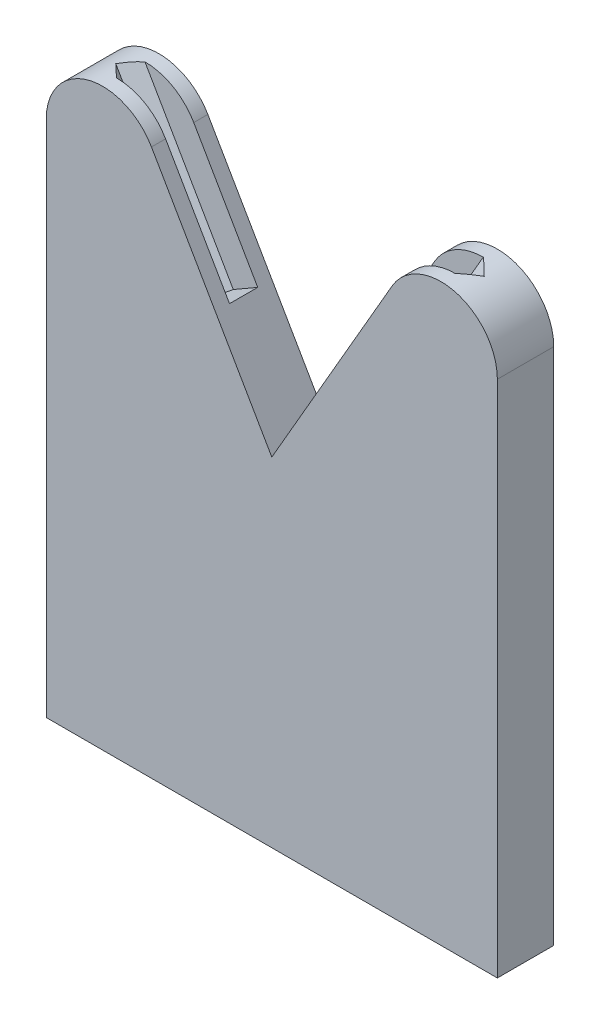
ISO-10303-21;
HEADER;
FILE_DESCRIPTION(('STEP AP214'),'2;1');
FILE_NAME('part.step','',(''),(''),'','','');
FILE_SCHEMA(('AUTOMOTIVE_DESIGN { 1 0 10303 214 1 1 1 1 }'));
ENDSEC;
DATA;
#1=APPLICATION_CONTEXT('core data for automotive mechanical design processes');
#2=APPLICATION_PROTOCOL_DEFINITION('international standard','automotive_design',2000,#1);
#3=PRODUCT_CONTEXT('',#1,'mechanical');
#4=PRODUCT('Part','Part','',(#3));
#5=PRODUCT_RELATED_PRODUCT_CATEGORY('part','',(#4));
#6=PRODUCT_DEFINITION_FORMATION('','',#4);
#7=PRODUCT_DEFINITION_CONTEXT('part definition',#1,'design');
#8=PRODUCT_DEFINITION('design','',#6,#7);
#9=PRODUCT_DEFINITION_SHAPE('','',#8);
#10=(LENGTH_UNIT() NAMED_UNIT(*) SI_UNIT(.MILLI.,.METRE.));
#11=(NAMED_UNIT(*) PLANE_ANGLE_UNIT() SI_UNIT($,.RADIAN.));
#12=(NAMED_UNIT(*) SI_UNIT($,.STERADIAN.) SOLID_ANGLE_UNIT());
#13=UNCERTAINTY_MEASURE_WITH_UNIT(LENGTH_MEASURE(1.E-05),#10,'distance_accuracy_value','');
#14=(GEOMETRIC_REPRESENTATION_CONTEXT(3) GLOBAL_UNCERTAINTY_ASSIGNED_CONTEXT((#13)) GLOBAL_UNIT_ASSIGNED_CONTEXT((#10,
#11,#12)) REPRESENTATION_CONTEXT('',''));
#15=CARTESIAN_POINT('',(0.,0.,0.));
#16=DIRECTION('',(0.,0.,1.));
#17=DIRECTION('',(1.,0.,0.));
#18=AXIS2_PLACEMENT_3D('',#15,#16,#17);
#19=CARTESIAN_POINT('',(50.8,87.9881810245001,6.35));
#20=DIRECTION('',(-1.,0.,0.));
#21=DIRECTION('',(0.,-1.,0.));
#22=AXIS2_PLACEMENT_3D('',#19,#20,#21);
#23=PLANE('',#22);
#24=DIRECTION('',(0.,1.,0.));
#25=VECTOR('',#24,1.);
#26=CARTESIAN_POINT('',(50.8,87.9881810245001,-6.35));
#27=LINE('',#26,#25);
#28=CARTESIAN_POINT('',(50.8,-76.2,-6.35));
#29=VERTEX_POINT('',#28);
#30=CARTESIAN_POINT('',(50.8,40.5911357683748,-6.35));
#31=VERTEX_POINT('',#30);
#32=EDGE_CURVE('E234',#29,#31,#27,.T.);
#33=ORIENTED_EDGE('',*,*,#32,.T.);
#34=DIRECTION('',(0.,0.,-1.));
#35=VECTOR('',#34,1.);
#36=CARTESIAN_POINT('',(50.8,40.5911357683748,6.35));
#37=LINE('',#36,#35);
#38=CARTESIAN_POINT('',(50.8,40.5911357683748,6.35));
#39=VERTEX_POINT('',#38);
#40=EDGE_CURVE('E257',#31,#39,#37,.F.);
#41=ORIENTED_EDGE('',*,*,#40,.T.);
#42=DIRECTION('',(0.,1.,0.));
#43=VECTOR('',#42,1.);
#44=CARTESIAN_POINT('',(50.8,87.9881810245001,6.35));
#45=LINE('',#44,#43);
#46=CARTESIAN_POINT('',(50.8,-76.2,6.35));
#47=VERTEX_POINT('',#46);
#48=EDGE_CURVE('E222',#47,#39,#45,.T.);
#49=ORIENTED_EDGE('',*,*,#48,.F.);
#50=DIRECTION('',(0.,0.,-1.));
#51=VECTOR('',#50,1.);
#52=CARTESIAN_POINT('',(50.8,-76.2,6.35));
#53=LINE('',#52,#51);
#54=EDGE_CURVE('E242',#47,#29,#53,.T.);
#55=ORIENTED_EDGE('',*,*,#54,.T.);
#56=EDGE_LOOP('',(#33,#41,#49,#55));
#57=FACE_BOUND('',#56,.T.);
#58=ADVANCED_FACE('F35',(#57),#23,.F.);
#59=CARTESIAN_POINT('',(0.,0.,6.35));
#60=DIRECTION('',(0.866025403784441,-0.499999999999995,0.));
#61=DIRECTION('',(0.499999999999995,0.866025403784441,0.));
#62=AXIS2_PLACEMENT_3D('',#59,#60,#61);
#63=PLANE('',#62);
#64=DIRECTION('',(0.500000000000001,0.866025403784438,0.));
#65=VECTOR('',#64,1.);
#66=CARTESIAN_POINT('',(12.7000000000005,21.9970452561256,-3.175));
#67=LINE('',#66,#65);
#68=CARTESIAN_POINT('',(12.7000000000004,21.9970452561257,-3.175));
#69=VERTEX_POINT('',#68);
#70=CARTESIAN_POINT('',(27.1014773719379,46.9411357683746,-3.175));
#71=VERTEX_POINT('',#70);
#72=EDGE_CURVE('E180',#69,#71,#67,.T.);
#73=ORIENTED_EDGE('',*,*,#72,.T.);
#74=DIRECTION('',(0.,0.,-1.));
#75=VECTOR('',#74,1.);
#76=CARTESIAN_POINT('',(27.1014773719376,46.9411357683747,6.35));
#77=LINE('',#76,#75);
#78=CARTESIAN_POINT('',(27.1014773719376,46.9411357683748,-6.35));
#79=VERTEX_POINT('',#78);
#80=EDGE_CURVE('E249',#71,#79,#77,.T.);
#81=ORIENTED_EDGE('',*,*,#80,.T.);
#82=DIRECTION('',(-0.499999999999995,-0.866025403784441,0.));
#83=VECTOR('',#82,1.);
#84=CARTESIAN_POINT('',(0.,0.,-6.35));
#85=LINE('',#84,#83);
#86=CARTESIAN_POINT('',(0.,0.,-6.35));
#87=VERTEX_POINT('',#86);
#88=EDGE_CURVE('E237',#79,#87,#85,.T.);
#89=ORIENTED_EDGE('',*,*,#88,.T.);
#90=DIRECTION('',(0.,0.,-1.));
#91=VECTOR('',#90,1.);
#92=CARTESIAN_POINT('',(0.,0.,6.35));
#93=LINE('',#92,#91);
#94=CARTESIAN_POINT('',(0.,0.,6.35));
#95=VERTEX_POINT('',#94);
#96=EDGE_CURVE('E230',#95,#87,#93,.T.);
#97=ORIENTED_EDGE('',*,*,#96,.F.);
#98=DIRECTION('',(-0.499999999999995,-0.866025403784441,0.));
#99=VECTOR('',#98,1.);
#100=CARTESIAN_POINT('',(0.,0.,6.35));
#101=LINE('',#100,#99);
#102=CARTESIAN_POINT('',(27.1014773719376,46.9411357683748,6.35));
#103=VERTEX_POINT('',#102);
#104=EDGE_CURVE('E225',#103,#95,#101,.T.);
#105=ORIENTED_EDGE('',*,*,#104,.F.);
#106=DIRECTION('',(0.,0.,-1.));
#107=VECTOR('',#106,1.);
#108=CARTESIAN_POINT('',(27.1014773719376,46.9411357683747,6.35));
#109=LINE('',#108,#107);
#110=CARTESIAN_POINT('',(27.1014773719379,46.9411357683746,3.175));
#111=VERTEX_POINT('',#110);
#112=EDGE_CURVE('E179',#103,#111,#109,.T.);
#113=ORIENTED_EDGE('',*,*,#112,.T.);
#114=DIRECTION('',(0.500000000000001,0.866025403784438,0.));
#115=VECTOR('',#114,1.);
#116=CARTESIAN_POINT('',(12.7000000000005,21.9970452561256,3.175));
#117=LINE('',#116,#115);
#118=CARTESIAN_POINT('',(12.7000000000005,21.9970452561256,3.175));
#119=VERTEX_POINT('',#118);
#120=EDGE_CURVE('E159',#119,#111,#117,.T.);
#121=ORIENTED_EDGE('',*,*,#120,.F.);
#122=DIRECTION('',(0.,0.,-1.));
#123=VECTOR('',#122,1.);
#124=CARTESIAN_POINT('',(12.7000000000005,21.9970452561256,-3.175));
#125=LINE('',#124,#123);
#126=EDGE_CURVE('E166',#119,#69,#125,.T.);
#127=ORIENTED_EDGE('',*,*,#126,.T.);
#128=EDGE_LOOP('',(#73,#81,#89,#97,#105,#113,#121,#127));
#129=FACE_BOUND('',#128,.T.);
#130=ADVANCED_FACE('F176',(#129),#63,.F.);
#131=CARTESIAN_POINT('',(-50.8,-76.2,6.35));
#132=DIRECTION('',(1.,0.,0.));
#133=DIRECTION('',(0.,1.,0.));
#134=AXIS2_PLACEMENT_3D('',#131,#132,#133);
#135=PLANE('',#134);
#136=DIRECTION('',(0.,-1.,0.));
#137=VECTOR('',#136,1.);
#138=CARTESIAN_POINT('',(-50.8,-76.2,6.35));
#139=LINE('',#138,#137);
#140=CARTESIAN_POINT('',(-50.8,40.5911357683748,6.35));
#141=VERTEX_POINT('',#140);
#142=CARTESIAN_POINT('',(-50.8,-76.2,6.35));
#143=VERTEX_POINT('',#142);
#144=EDGE_CURVE('E217',#141,#143,#139,.T.);
#145=ORIENTED_EDGE('',*,*,#144,.F.);
#146=DIRECTION('',(0.,0.,-1.));
#147=VECTOR('',#146,1.);
#148=CARTESIAN_POINT('',(-50.8,40.5911357683748,6.35));
#149=LINE('',#148,#147);
#150=CARTESIAN_POINT('',(-50.8,40.5911357683748,-6.35));
#151=VERTEX_POINT('',#150);
#152=EDGE_CURVE('E272',#141,#151,#149,.T.);
#153=ORIENTED_EDGE('',*,*,#152,.T.);
#154=DIRECTION('',(0.,-1.,0.));
#155=VECTOR('',#154,1.);
#156=CARTESIAN_POINT('',(-50.8,-76.2,-6.35));
#157=LINE('',#156,#155);
#158=CARTESIAN_POINT('',(-50.8,-76.2,-6.35));
#159=VERTEX_POINT('',#158);
#160=EDGE_CURVE('E206',#151,#159,#157,.T.);
#161=ORIENTED_EDGE('',*,*,#160,.T.);
#162=DIRECTION('',(0.,0.,-1.));
#163=VECTOR('',#162,1.);
#164=CARTESIAN_POINT('',(-50.8,-76.2,6.35));
#165=LINE('',#164,#163);
#166=EDGE_CURVE('E245',#143,#159,#165,.T.);
#167=ORIENTED_EDGE('',*,*,#166,.F.);
#168=EDGE_LOOP('',(#145,#153,#161,#167));
#169=FACE_BOUND('',#168,.T.);
#170=ADVANCED_FACE('F295',(#169),#135,.F.);
#171=CARTESIAN_POINT('',(50.8,-76.2,6.35));
#172=DIRECTION('',(0.,1.,0.));
#173=DIRECTION('',(-1.,0.,0.));
#174=AXIS2_PLACEMENT_3D('',#171,#172,#173);
#175=PLANE('',#174);
#176=DIRECTION('',(1.,0.,0.));
#177=VECTOR('',#176,1.);
#178=CARTESIAN_POINT('',(50.8,-76.2,-6.35));
#179=LINE('',#178,#177);
#180=EDGE_CURVE('E232',#159,#29,#179,.T.);
#181=ORIENTED_EDGE('',*,*,#180,.T.);
#182=ORIENTED_EDGE('',*,*,#54,.F.);
#183=DIRECTION('',(1.,0.,0.));
#184=VECTOR('',#183,1.);
#185=CARTESIAN_POINT('',(50.8,-76.2,6.35));
#186=LINE('',#185,#184);
#187=EDGE_CURVE('E219',#143,#47,#186,.T.);
#188=ORIENTED_EDGE('',*,*,#187,.F.);
#189=ORIENTED_EDGE('',*,*,#166,.T.);
#190=EDGE_LOOP('',(#181,#182,#188,#189));
#191=FACE_BOUND('',#190,.T.);
#192=ADVANCED_FACE('F306',(#191),#175,.F.);
#193=CARTESIAN_POINT('',(-50.8,87.9881810245001,6.35));
#194=DIRECTION('',(-0.866025403784441,-0.499999999999995,0.));
#195=DIRECTION('',(0.499999999999995,-0.866025403784441,0.));
#196=AXIS2_PLACEMENT_3D('',#193,#194,#195);
#197=PLANE('',#196);
#198=DIRECTION('',(-0.500000000000001,0.866025403784438,0.));
#199=VECTOR('',#198,1.);
#200=CARTESIAN_POINT('',(-12.7000000000005,21.9970452561256,3.175));
#201=LINE('',#200,#199);
#202=CARTESIAN_POINT('',(-12.7000000000004,21.9970452561257,3.175));
#203=VERTEX_POINT('',#202);
#204=CARTESIAN_POINT('',(-27.1014773719379,46.9411357683746,3.175));
#205=VERTEX_POINT('',#204);
#206=EDGE_CURVE('E207',#203,#205,#201,.T.);
#207=ORIENTED_EDGE('',*,*,#206,.T.);
#208=DIRECTION('',(0.,0.,-1.));
#209=VECTOR('',#208,1.);
#210=CARTESIAN_POINT('',(-27.1014773719376,46.9411357683747,6.35));
#211=LINE('',#210,#209);
#212=CARTESIAN_POINT('',(-27.1014773719376,46.9411357683747,6.35));
#213=VERTEX_POINT('',#212);
#214=EDGE_CURVE('E279',#205,#213,#211,.F.);
#215=ORIENTED_EDGE('',*,*,#214,.T.);
#216=DIRECTION('',(-0.499999999999995,0.866025403784441,0.));
#217=VECTOR('',#216,1.);
#218=CARTESIAN_POINT('',(-50.8,87.9881810245001,6.35));
#219=LINE('',#218,#217);
#220=EDGE_CURVE('E227',#95,#213,#219,.T.);
#221=ORIENTED_EDGE('',*,*,#220,.F.);
#222=ORIENTED_EDGE('',*,*,#96,.T.);
#223=DIRECTION('',(-0.499999999999995,0.866025403784441,0.));
#224=VECTOR('',#223,1.);
#225=CARTESIAN_POINT('',(-50.8,87.9881810245001,-6.35));
#226=LINE('',#225,#224);
#227=CARTESIAN_POINT('',(-27.1014773719376,46.9411357683747,-6.35));
#228=VERTEX_POINT('',#227);
#229=EDGE_CURVE('E220',#87,#228,#226,.T.);
#230=ORIENTED_EDGE('',*,*,#229,.T.);
#231=DIRECTION('',(0.,0.,-1.));
#232=VECTOR('',#231,1.);
#233=CARTESIAN_POINT('',(-27.1014773719376,46.9411357683747,6.35));
#234=LINE('',#233,#232);
#235=CARTESIAN_POINT('',(-27.1014773719379,46.9411357683746,-3.175));
#236=VERTEX_POINT('',#235);
#237=EDGE_CURVE('E57',#228,#236,#234,.F.);
#238=ORIENTED_EDGE('',*,*,#237,.T.);
#239=DIRECTION('',(-0.500000000000001,0.866025403784438,0.));
#240=VECTOR('',#239,1.);
#241=CARTESIAN_POINT('',(-12.7000000000005,21.9970452561256,-3.175));
#242=LINE('',#241,#240);
#243=CARTESIAN_POINT('',(-12.7000000000005,21.9970452561256,-3.175));
#244=VERTEX_POINT('',#243);
#245=EDGE_CURVE('E204',#244,#236,#242,.T.);
#246=ORIENTED_EDGE('',*,*,#245,.F.);
#247=DIRECTION('',(0.,0.,-1.));
#248=VECTOR('',#247,1.);
#249=CARTESIAN_POINT('',(-12.7000000000005,21.9970452561256,-3.175));
#250=LINE('',#249,#248);
#251=EDGE_CURVE('E200',#203,#244,#250,.T.);
#252=ORIENTED_EDGE('',*,*,#251,.F.);
#253=EDGE_LOOP('',(#207,#215,#221,#222,#230,#238,#246,#252));
#254=FACE_BOUND('',#253,.T.);
#255=ADVANCED_FACE('F282',(#254),#197,.F.);
#256=CARTESIAN_POINT('',(0.,0.,6.35));
#257=DIRECTION('',(0.,0.,1.));
#258=DIRECTION('',(1.,0.,0.));
#259=AXIS2_PLACEMENT_3D('',#256,#257,#258);
#260=PLANE('',#259);
#261=ORIENTED_EDGE('',*,*,#48,.T.);
#262=CARTESIAN_POINT('',(38.1,40.5911357683748,6.35));
#263=DIRECTION('',(0.,0.,1.));
#264=DIRECTION('',(1.,0.,0.));
#265=AXIS2_PLACEMENT_3D('',#262,#263,#264);
#266=CIRCLE('',#265,12.7);
#267=EDGE_CURVE('E270',#39,#103,#266,.T.);
#268=ORIENTED_EDGE('',*,*,#267,.T.);
#269=ORIENTED_EDGE('',*,*,#104,.T.);
#270=ORIENTED_EDGE('',*,*,#220,.T.);
#271=CARTESIAN_POINT('',(-38.1,40.5911357683748,6.35));
#272=DIRECTION('',(0.,0.,1.));
#273=DIRECTION('',(1.,0.,0.));
#274=AXIS2_PLACEMENT_3D('',#271,#272,#273);
#275=CIRCLE('',#274,12.7);
#276=EDGE_CURVE('E267',#213,#141,#275,.T.);
#277=ORIENTED_EDGE('',*,*,#276,.T.);
#278=ORIENTED_EDGE('',*,*,#144,.T.);
#279=ORIENTED_EDGE('',*,*,#187,.T.);
#280=EDGE_LOOP('',(#261,#268,#269,#270,#277,#278,#279));
#281=FACE_BOUND('',#280,.T.);
#282=ADVANCED_FACE('F289',(#281),#260,.T.);
#283=CARTESIAN_POINT('',(0.,0.,-6.35));
#284=DIRECTION('',(0.,0.,1.));
#285=DIRECTION('',(1.,0.,0.));
#286=AXIS2_PLACEMENT_3D('',#283,#284,#285);
#287=PLANE('',#286);
#288=ORIENTED_EDGE('',*,*,#88,.F.);
#289=CARTESIAN_POINT('',(38.1,40.5911357683748,-6.35));
#290=DIRECTION('',(0.,0.,1.));
#291=DIRECTION('',(1.,0.,0.));
#292=AXIS2_PLACEMENT_3D('',#289,#290,#291);
#293=CIRCLE('',#292,12.7);
#294=EDGE_CURVE('E254',#79,#31,#293,.F.);
#295=ORIENTED_EDGE('',*,*,#294,.T.);
#296=ORIENTED_EDGE('',*,*,#32,.F.);
#297=ORIENTED_EDGE('',*,*,#180,.F.);
#298=ORIENTED_EDGE('',*,*,#160,.F.);
#299=CARTESIAN_POINT('',(-38.1,40.5911357683748,-6.35));
#300=DIRECTION('',(0.,0.,1.));
#301=DIRECTION('',(1.,0.,0.));
#302=AXIS2_PLACEMENT_3D('',#299,#300,#301);
#303=CIRCLE('',#302,12.7);
#304=EDGE_CURVE('E252',#151,#228,#303,.F.);
#305=ORIENTED_EDGE('',*,*,#304,.T.);
#306=ORIENTED_EDGE('',*,*,#229,.F.);
#307=EDGE_LOOP('',(#288,#295,#296,#297,#298,#305,#306));
#308=FACE_BOUND('',#307,.T.);
#309=ADVANCED_FACE('F300',(#308),#287,.F.);
#310=CARTESIAN_POINT('',(-18.1992613140317,18.8220452561255,3.175));
#311=DIRECTION('',(-0.612372435695795,-0.353553390593275,0.707106781186547));
#312=DIRECTION('',(0.755928946018454,0.,0.654653670707978));
#313=AXIS2_PLACEMENT_3D('',#310,#311,#312);
#314=PLANE('',#313);
#315=DIRECTION('',(-0.500000000000001,0.866025403784438,0.));
#316=VECTOR('',#315,1.);
#317=CARTESIAN_POINT('',(-20.9488919710473,17.2345452561256,0.));
#318=LINE('',#317,#316);
#319=CARTESIAN_POINT('',(-20.9488919710473,17.2345452561256,0.));
#320=VERTEX_POINT('',#319);
#321=CARTESIAN_POINT('',(-41.498730405089,52.8279095112175,0.));
#322=VERTEX_POINT('',#321);
#323=EDGE_CURVE('E213',#320,#322,#318,.T.);
#324=ORIENTED_EDGE('',*,*,#323,.T.);
#325=CARTESIAN_POINT('',(-38.1,40.5911357683748,-3.17499999999965));
#326=DIRECTION('',(-0.612372435695795,-0.353553390593275,0.707106781186547));
#327=DIRECTION('',(-0.612372435695794,-0.353553390593274,-0.707106781186548));
#328=AXIS2_PLACEMENT_3D('',#325,#326,#327);
#329=ELLIPSE('',#328,17.9605122421383,12.7);
#330=CARTESIAN_POINT('',(-38.1000000000004,53.2911357683748,3.175));
#331=VERTEX_POINT('',#330);
#332=EDGE_CURVE('E274',#322,#331,#329,.F.);
#333=ORIENTED_EDGE('',*,*,#332,.T.);
#334=DIRECTION('',(-0.500000000000001,0.866025403784438,0.));
#335=VECTOR('',#334,1.);
#336=CARTESIAN_POINT('',(-18.1992613140317,18.8220452561255,3.175));
#337=LINE('',#336,#335);
#338=CARTESIAN_POINT('',(-18.1992613140317,18.8220452561255,3.175));
#339=VERTEX_POINT('',#338);
#340=EDGE_CURVE('E210',#339,#331,#337,.T.);
#341=ORIENTED_EDGE('',*,*,#340,.F.);
#342=DIRECTION('',(0.612372435695795,0.353553390593272,0.707106781186548));
#343=VECTOR('',#342,1.);
#344=CARTESIAN_POINT('',(-18.1992613140317,18.8220452561255,3.175));
#345=LINE('',#344,#343);
#346=EDGE_CURVE('E195',#320,#339,#345,.T.);
#347=ORIENTED_EDGE('',*,*,#346,.F.);
#348=EDGE_LOOP('',(#324,#333,#341,#347));
#349=FACE_BOUND('',#348,.T.);
#350=ADVANCED_FACE('F336',(#349),#314,.F.);
#351=CARTESIAN_POINT('',(-20.9488919710473,17.2345452561256,0.));
#352=DIRECTION('',(-0.612372435695794,-0.353553390593275,-0.707106781186547));
#353=DIRECTION('',(-0.755928946018455,0.,0.654653670707977));
#354=AXIS2_PLACEMENT_3D('',#351,#352,#353);
#355=PLANE('',#354);
#356=DIRECTION('',(-0.500000000000001,0.866025403784438,0.));
#357=VECTOR('',#356,1.);
#358=CARTESIAN_POINT('',(-18.1992613140317,18.8220452561255,-3.175));
#359=LINE('',#358,#357);
#360=CARTESIAN_POINT('',(-18.1992613140317,18.8220452561255,-3.175));
#361=VERTEX_POINT('',#360);
#362=CARTESIAN_POINT('',(-38.1000000000004,53.2911357683748,-3.175));
#363=VERTEX_POINT('',#362);
#364=EDGE_CURVE('E203',#361,#363,#359,.T.);
#365=ORIENTED_EDGE('',*,*,#364,.T.);
#366=CARTESIAN_POINT('',(-38.1,40.5911357683748,3.17499999999965));
#367=DIRECTION('',(-0.612372435695794,-0.353553390593275,-0.707106781186547));
#368=DIRECTION('',(0.612372435695794,0.353553390593274,-0.707106781186548));
#369=AXIS2_PLACEMENT_3D('',#366,#367,#368);
#370=ELLIPSE('',#369,17.9605122421383,12.7);
#371=EDGE_CURVE('E11',#363,#322,#370,.F.);
#372=ORIENTED_EDGE('',*,*,#371,.T.);
#373=ORIENTED_EDGE('',*,*,#323,.F.);
#374=DIRECTION('',(-0.612372435695795,-0.353553390593272,0.707106781186548));
#375=VECTOR('',#374,1.);
#376=CARTESIAN_POINT('',(-20.9488919710473,17.2345452561256,0.));
#377=LINE('',#376,#375);
#378=EDGE_CURVE('E191',#361,#320,#377,.T.);
#379=ORIENTED_EDGE('',*,*,#378,.F.);
#380=EDGE_LOOP('',(#365,#372,#373,#379));
#381=FACE_BOUND('',#380,.T.);
#382=ADVANCED_FACE('F332',(#381),#355,.F.);
#383=CARTESIAN_POINT('',(-18.1992613140317,18.8220452561255,-3.175));
#384=DIRECTION('',(0.,0.,-1.));
#385=DIRECTION('',(-1.,0.,0.));
#386=AXIS2_PLACEMENT_3D('',#383,#384,#385);
#387=PLANE('',#386);
#388=ORIENTED_EDGE('',*,*,#245,.T.);
#389=CARTESIAN_POINT('',(-38.1,40.5911357683748,-3.175));
#390=DIRECTION('',(0.,0.,-1.));
#391=DIRECTION('',(-1.,0.,0.));
#392=AXIS2_PLACEMENT_3D('',#389,#390,#391);
#393=CIRCLE('',#392,12.7);
#394=EDGE_CURVE('E43',#236,#363,#393,.F.);
#395=ORIENTED_EDGE('',*,*,#394,.T.);
#396=ORIENTED_EDGE('',*,*,#364,.F.);
#397=DIRECTION('',(-0.866025403784438,-0.500000000000002,0.));
#398=VECTOR('',#397,1.);
#399=CARTESIAN_POINT('',(-18.1992613140317,18.8220452561255,-3.175));
#400=LINE('',#399,#398);
#401=EDGE_CURVE('E188',#244,#361,#400,.T.);
#402=ORIENTED_EDGE('',*,*,#401,.F.);
#403=EDGE_LOOP('',(#388,#395,#396,#402));
#404=FACE_BOUND('',#403,.T.);
#405=ADVANCED_FACE('F340',(#404),#387,.F.);
#406=CARTESIAN_POINT('',(-12.7000000000005,21.9970452561256,3.175));
#407=DIRECTION('',(0.,0.,1.));
#408=DIRECTION('',(1.,0.,0.));
#409=AXIS2_PLACEMENT_3D('',#406,#407,#408);
#410=PLANE('',#409);
#411=ORIENTED_EDGE('',*,*,#340,.T.);
#412=CARTESIAN_POINT('',(-38.1,40.5911357683748,3.175));
#413=DIRECTION('',(0.,0.,1.));
#414=DIRECTION('',(1.,0.,0.));
#415=AXIS2_PLACEMENT_3D('',#412,#413,#414);
#416=CIRCLE('',#415,12.7);
#417=EDGE_CURVE('E276',#331,#205,#416,.F.);
#418=ORIENTED_EDGE('',*,*,#417,.T.);
#419=ORIENTED_EDGE('',*,*,#206,.F.);
#420=DIRECTION('',(0.866025403784438,0.500000000000002,0.));
#421=VECTOR('',#420,1.);
#422=CARTESIAN_POINT('',(-12.7000000000005,21.9970452561256,3.175));
#423=LINE('',#422,#421);
#424=EDGE_CURVE('E198',#339,#203,#423,.T.);
#425=ORIENTED_EDGE('',*,*,#424,.F.);
#426=EDGE_LOOP('',(#411,#418,#419,#425));
#427=FACE_BOUND('',#426,.T.);
#428=ADVANCED_FACE('F342',(#427),#410,.F.);
#429=CARTESIAN_POINT('',(-12.7000000000006,21.9970452561256,0.));
#430=DIRECTION('',(0.500000000000002,-0.866025403784438,0.));
#431=DIRECTION('',(0.866025403784438,0.500000000000002,0.));
#432=AXIS2_PLACEMENT_3D('',#429,#430,#431);
#433=PLANE('',#432);
#434=ORIENTED_EDGE('',*,*,#401,.T.);
#435=ORIENTED_EDGE('',*,*,#378,.T.);
#436=ORIENTED_EDGE('',*,*,#346,.T.);
#437=ORIENTED_EDGE('',*,*,#424,.T.);
#438=ORIENTED_EDGE('',*,*,#251,.T.);
#439=EDGE_LOOP('',(#434,#435,#436,#437,#438));
#440=FACE_BOUND('',#439,.T.);
#441=ADVANCED_FACE('F339',(#440),#433,.F.);
#442=CARTESIAN_POINT('',(20.9488919710473,17.2345452561256,0.));
#443=DIRECTION('',(-0.612372435695794,0.353553390593275,0.707106781186547));
#444=DIRECTION('',(0.755928946018455,0.,0.654653670707977));
#445=AXIS2_PLACEMENT_3D('',#442,#443,#444);
#446=PLANE('',#445);
#447=DIRECTION('',(0.500000000000001,0.866025403784438,0.));
#448=VECTOR('',#447,1.);
#449=CARTESIAN_POINT('',(20.9488919710473,17.2345452561256,0.));
#450=LINE('',#449,#448);
#451=CARTESIAN_POINT('',(20.9488919710473,17.2345452561256,0.));
#452=VERTEX_POINT('',#451);
#453=CARTESIAN_POINT('',(41.498730405089,52.8279095112175,0.));
#454=VERTEX_POINT('',#453);
#455=EDGE_CURVE('E182',#452,#454,#450,.T.);
#456=ORIENTED_EDGE('',*,*,#455,.T.);
#457=CARTESIAN_POINT('',(38.1,40.5911357683748,3.17499999999964));
#458=DIRECTION('',(-0.612372435695794,0.353553390593275,0.707106781186547));
#459=DIRECTION('',(-0.612372435695794,0.353553390593274,-0.707106781186548));
#460=AXIS2_PLACEMENT_3D('',#457,#458,#459);
#461=ELLIPSE('',#460,17.9605122421383,12.7);
#462=CARTESIAN_POINT('',(38.1000000000004,53.2911357683748,-3.175));
#463=VERTEX_POINT('',#462);
#464=EDGE_CURVE('E259',#454,#463,#461,.T.);
#465=ORIENTED_EDGE('',*,*,#464,.T.);
#466=DIRECTION('',(0.500000000000001,0.866025403784438,0.));
#467=VECTOR('',#466,1.);
#468=CARTESIAN_POINT('',(18.1992613140317,18.8220452561255,-3.175));
#469=LINE('',#468,#467);
#470=CARTESIAN_POINT('',(18.1992613140317,18.8220452561255,-3.175));
#471=VERTEX_POINT('',#470);
#472=EDGE_CURVE('E192',#471,#463,#469,.T.);
#473=ORIENTED_EDGE('',*,*,#472,.F.);
#474=DIRECTION('',(0.612372435695795,-0.353553390593272,0.707106781186548));
#475=VECTOR('',#474,1.);
#476=CARTESIAN_POINT('',(20.9488919710473,17.2345452561256,0.));
#477=LINE('',#476,#475);
#478=EDGE_CURVE('E184',#471,#452,#477,.T.);
#479=ORIENTED_EDGE('',*,*,#478,.T.);
#480=EDGE_LOOP('',(#456,#465,#473,#479));
#481=FACE_BOUND('',#480,.T.);
#482=ADVANCED_FACE('F323',(#481),#446,.T.);
#483=CARTESIAN_POINT('',(18.1992613140317,18.8220452561255,3.175));
#484=DIRECTION('',(-0.612372435695795,0.353553390593275,-0.707106781186547));
#485=DIRECTION('',(-0.755928946018454,0.,0.654653670707978));
#486=AXIS2_PLACEMENT_3D('',#483,#484,#485);
#487=PLANE('',#486);
#488=DIRECTION('',(0.500000000000001,0.866025403784438,0.));
#489=VECTOR('',#488,1.);
#490=CARTESIAN_POINT('',(18.1992613140317,18.8220452561255,3.175));
#491=LINE('',#490,#489);
#492=CARTESIAN_POINT('',(18.1992613140317,18.8220452561255,3.175));
#493=VERTEX_POINT('',#492);
#494=CARTESIAN_POINT('',(38.1000000000004,53.2911357683748,3.175));
#495=VERTEX_POINT('',#494);
#496=EDGE_CURVE('E162',#493,#495,#491,.T.);
#497=ORIENTED_EDGE('',*,*,#496,.T.);
#498=CARTESIAN_POINT('',(38.1,40.5911357683748,-3.17499999999965));
#499=DIRECTION('',(-0.612372435695795,0.353553390593275,-0.707106781186547));
#500=DIRECTION('',(0.612372435695794,-0.353553390593274,-0.707106781186548));
#501=AXIS2_PLACEMENT_3D('',#498,#499,#500);
#502=ELLIPSE('',#501,17.9605122421383,12.7);
#503=EDGE_CURVE('E265',#495,#454,#502,.T.);
#504=ORIENTED_EDGE('',*,*,#503,.T.);
#505=ORIENTED_EDGE('',*,*,#455,.F.);
#506=DIRECTION('',(-0.612372435695795,0.353553390593272,0.707106781186548));
#507=VECTOR('',#506,1.);
#508=CARTESIAN_POINT('',(18.1992613140317,18.8220452561255,3.175));
#509=LINE('',#508,#507);
#510=EDGE_CURVE('E165',#452,#493,#509,.T.);
#511=ORIENTED_EDGE('',*,*,#510,.T.);
#512=EDGE_LOOP('',(#497,#504,#505,#511));
#513=FACE_BOUND('',#512,.T.);
#514=ADVANCED_FACE('F315',(#513),#487,.T.);
#515=CARTESIAN_POINT('',(18.1992613140317,18.8220452561255,-3.175));
#516=DIRECTION('',(0.,0.,1.));
#517=DIRECTION('',(1.,0.,0.));
#518=AXIS2_PLACEMENT_3D('',#515,#516,#517);
#519=PLANE('',#518);
#520=ORIENTED_EDGE('',*,*,#472,.T.);
#521=CARTESIAN_POINT('',(38.1,40.5911357683748,-3.175));
#522=DIRECTION('',(0.,0.,1.));
#523=DIRECTION('',(1.,0.,0.));
#524=AXIS2_PLACEMENT_3D('',#521,#522,#523);
#525=CIRCLE('',#524,12.7);
#526=EDGE_CURVE('E261',#463,#71,#525,.T.);
#527=ORIENTED_EDGE('',*,*,#526,.T.);
#528=ORIENTED_EDGE('',*,*,#72,.F.);
#529=DIRECTION('',(0.866025403784438,-0.500000000000002,0.));
#530=VECTOR('',#529,1.);
#531=CARTESIAN_POINT('',(18.1992613140317,18.8220452561255,-3.175));
#532=LINE('',#531,#530);
#533=EDGE_CURVE('E171',#69,#471,#532,.T.);
#534=ORIENTED_EDGE('',*,*,#533,.T.);
#535=EDGE_LOOP('',(#520,#527,#528,#534));
#536=FACE_BOUND('',#535,.T.);
#537=ADVANCED_FACE('F328',(#536),#519,.T.);
#538=CARTESIAN_POINT('',(12.7000000000005,21.9970452561256,3.175));
#539=DIRECTION('',(0.,0.,-1.));
#540=DIRECTION('',(-1.,0.,0.));
#541=AXIS2_PLACEMENT_3D('',#538,#539,#540);
#542=PLANE('',#541);
#543=ORIENTED_EDGE('',*,*,#120,.T.);
#544=CARTESIAN_POINT('',(38.1,40.5911357683748,3.175));
#545=DIRECTION('',(0.,0.,-1.));
#546=DIRECTION('',(-1.,0.,0.));
#547=AXIS2_PLACEMENT_3D('',#544,#545,#546);
#548=CIRCLE('',#547,12.7);
#549=EDGE_CURVE('E263',#111,#495,#548,.T.);
#550=ORIENTED_EDGE('',*,*,#549,.T.);
#551=ORIENTED_EDGE('',*,*,#496,.F.);
#552=DIRECTION('',(-0.866025403784438,0.500000000000002,0.));
#553=VECTOR('',#552,1.);
#554=CARTESIAN_POINT('',(12.7000000000005,21.9970452561256,3.175));
#555=LINE('',#554,#553);
#556=EDGE_CURVE('E155',#493,#119,#555,.T.);
#557=ORIENTED_EDGE('',*,*,#556,.T.);
#558=EDGE_LOOP('',(#543,#550,#551,#557));
#559=FACE_BOUND('',#558,.T.);
#560=ADVANCED_FACE('F157',(#559),#542,.T.);
#561=CARTESIAN_POINT('',(12.7000000000006,21.9970452561256,0.));
#562=DIRECTION('',(-0.500000000000002,-0.866025403784438,0.));
#563=DIRECTION('',(-0.866025403784438,0.500000000000002,0.));
#564=AXIS2_PLACEMENT_3D('',#561,#562,#563);
#565=PLANE('',#564);
#566=ORIENTED_EDGE('',*,*,#533,.F.);
#567=ORIENTED_EDGE('',*,*,#126,.F.);
#568=ORIENTED_EDGE('',*,*,#556,.F.);
#569=ORIENTED_EDGE('',*,*,#510,.F.);
#570=ORIENTED_EDGE('',*,*,#478,.F.);
#571=EDGE_LOOP('',(#566,#567,#568,#569,#570));
#572=FACE_BOUND('',#571,.T.);
#573=ADVANCED_FACE('F169',(#572),#565,.F.);
#574=CARTESIAN_POINT('',(38.1,40.5911357683748,6.35));
#575=DIRECTION('',(0.,0.,-1.));
#576=DIRECTION('',(-1.,0.,0.));
#577=AXIS2_PLACEMENT_3D('',#574,#575,#576);
#578=CYLINDRICAL_SURFACE('',#577,12.7);
#579=ORIENTED_EDGE('',*,*,#267,.F.);
#580=ORIENTED_EDGE('',*,*,#40,.F.);
#581=ORIENTED_EDGE('',*,*,#294,.F.);
#582=ORIENTED_EDGE('',*,*,#80,.F.);
#583=ORIENTED_EDGE('',*,*,#526,.F.);
#584=ORIENTED_EDGE('',*,*,#464,.F.);
#585=ORIENTED_EDGE('',*,*,#503,.F.);
#586=ORIENTED_EDGE('',*,*,#549,.F.);
#587=ORIENTED_EDGE('',*,*,#112,.F.);
#588=EDGE_LOOP('',(#579,#580,#581,#582,#583,#584,#585,#586,#587));
#589=FACE_BOUND('',#588,.T.);
#590=ADVANCED_FACE('F311',(#589),#578,.T.);
#591=CARTESIAN_POINT('',(-38.1,40.5911357683748,6.35));
#592=DIRECTION('',(0.,0.,-1.));
#593=DIRECTION('',(-1.,0.,0.));
#594=AXIS2_PLACEMENT_3D('',#591,#592,#593);
#595=CYLINDRICAL_SURFACE('',#594,12.7);
#596=ORIENTED_EDGE('',*,*,#304,.F.);
#597=ORIENTED_EDGE('',*,*,#152,.F.);
#598=ORIENTED_EDGE('',*,*,#276,.F.);
#599=ORIENTED_EDGE('',*,*,#214,.F.);
#600=ORIENTED_EDGE('',*,*,#417,.F.);
#601=ORIENTED_EDGE('',*,*,#332,.F.);
#602=ORIENTED_EDGE('',*,*,#371,.F.);
#603=ORIENTED_EDGE('',*,*,#394,.F.);
#604=ORIENTED_EDGE('',*,*,#237,.F.);
#605=EDGE_LOOP('',(#596,#597,#598,#599,#600,#601,#602,#603,#604));
#606=FACE_BOUND('',#605,.T.);
#607=ADVANCED_FACE('F37',(#606),#595,.T.);
#608=CLOSED_SHELL('',(#58,#130,#170,#192,#255,#282,#309,#350,#382,#405,#428,#441,#482,#514,#537,
#560,#573,#590,#607));
#609=MANIFOLD_SOLID_BREP('B2',#608);
#610=ADVANCED_BREP_SHAPE_REPRESENTATION('',(#18,#609),#14);
#611=SHAPE_DEFINITION_REPRESENTATION(#9,#610);
ENDSEC;
END-ISO-10303-21;
